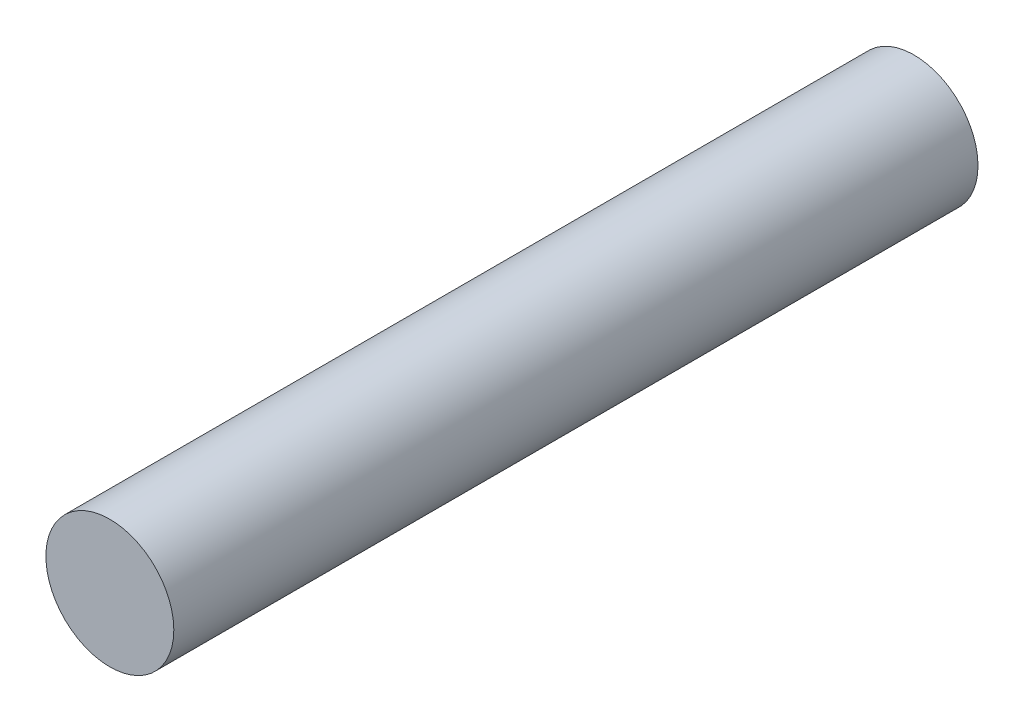
ISO-10303-21;
HEADER;
FILE_DESCRIPTION(('STEP AP214'),'2;1');
FILE_NAME('part.step','',(''),(''),'','','');
FILE_SCHEMA(('AUTOMOTIVE_DESIGN { 1 0 10303 214 1 1 1 1 }'));
ENDSEC;
DATA;
#1=APPLICATION_CONTEXT('core data for automotive mechanical design processes');
#2=APPLICATION_PROTOCOL_DEFINITION('international standard','automotive_design',2000,#1);
#3=PRODUCT_CONTEXT('',#1,'mechanical');
#4=PRODUCT('Part','Part','',(#3));
#5=PRODUCT_RELATED_PRODUCT_CATEGORY('part','',(#4));
#6=PRODUCT_DEFINITION_FORMATION('','',#4);
#7=PRODUCT_DEFINITION_CONTEXT('part definition',#1,'design');
#8=PRODUCT_DEFINITION('design','',#6,#7);
#9=PRODUCT_DEFINITION_SHAPE('','',#8);
#10=(LENGTH_UNIT() NAMED_UNIT(*) SI_UNIT(.MILLI.,.METRE.));
#11=(NAMED_UNIT(*) PLANE_ANGLE_UNIT() SI_UNIT($,.RADIAN.));
#12=(NAMED_UNIT(*) SI_UNIT($,.STERADIAN.) SOLID_ANGLE_UNIT());
#13=UNCERTAINTY_MEASURE_WITH_UNIT(LENGTH_MEASURE(1.E-05),#10,'distance_accuracy_value','');
#14=(GEOMETRIC_REPRESENTATION_CONTEXT(3) GLOBAL_UNCERTAINTY_ASSIGNED_CONTEXT((#13)) GLOBAL_UNIT_ASSIGNED_CONTEXT((#10,
#11,#12)) REPRESENTATION_CONTEXT('',''));
#15=CARTESIAN_POINT('',(0.,0.,0.));
#16=DIRECTION('',(0.,0.,1.));
#17=DIRECTION('',(1.,0.,0.));
#18=AXIS2_PLACEMENT_3D('',#15,#16,#17);
#19=CARTESIAN_POINT('',(0.,0.,139.7));
#20=DIRECTION('',(0.,0.,-1.));
#21=DIRECTION('',(-1.,0.,0.));
#22=AXIS2_PLACEMENT_3D('',#19,#20,#21);
#23=CYLINDRICAL_SURFACE('',#22,11.1125);
#24=CARTESIAN_POINT('',(0.,0.,139.7));
#25=DIRECTION('',(0.,0.,1.));
#26=DIRECTION('',(1.,0.,0.));
#27=AXIS2_PLACEMENT_3D('',#24,#25,#26);
#28=CIRCLE('',#27,11.1125);
#29=CARTESIAN_POINT('',(11.1125,0.,139.7));
#30=VERTEX_POINT('',#29);
#31=EDGE_CURVE('E10',#30,#30,#28,.T.);
#32=ORIENTED_EDGE('',*,*,#31,.F.);
#33=EDGE_LOOP('',(#32));
#34=FACE_BOUND('',#33,.T.);
#35=CARTESIAN_POINT('',(0.,0.,0.));
#36=DIRECTION('',(0.,0.,1.));
#37=DIRECTION('',(1.,0.,0.));
#38=AXIS2_PLACEMENT_3D('',#35,#36,#37);
#39=CIRCLE('',#38,11.1125);
#40=CARTESIAN_POINT('',(11.1125,0.,0.));
#41=VERTEX_POINT('',#40);
#42=EDGE_CURVE('E35',#41,#41,#39,.T.);
#43=ORIENTED_EDGE('',*,*,#42,.T.);
#44=EDGE_LOOP('',(#43));
#45=FACE_BOUND('',#44,.T.);
#46=ADVANCED_FACE('F32',(#34,#45),#23,.T.);
#47=CARTESIAN_POINT('',(0.,0.,139.7));
#48=DIRECTION('',(0.,0.,1.));
#49=DIRECTION('',(1.,0.,0.));
#50=AXIS2_PLACEMENT_3D('',#47,#48,#49);
#51=PLANE('',#50);
#52=ORIENTED_EDGE('',*,*,#31,.T.);
#53=EDGE_LOOP('',(#52));
#54=FACE_BOUND('',#53,.T.);
#55=ADVANCED_FACE('F47',(#54),#51,.T.);
#56=CARTESIAN_POINT('',(0.,0.,0.));
#57=DIRECTION('',(0.,0.,1.));
#58=DIRECTION('',(1.,0.,0.));
#59=AXIS2_PLACEMENT_3D('',#56,#57,#58);
#60=PLANE('',#59);
#61=ORIENTED_EDGE('',*,*,#42,.F.);
#62=EDGE_LOOP('',(#61));
#63=FACE_BOUND('',#62,.T.);
#64=ADVANCED_FACE('F45',(#63),#60,.F.);
#65=CLOSED_SHELL('',(#46,#55,#64));
#66=MANIFOLD_SOLID_BREP('B2',#65);
#67=ADVANCED_BREP_SHAPE_REPRESENTATION('',(#18,#66),#14);
#68=SHAPE_DEFINITION_REPRESENTATION(#9,#67);
ENDSEC;
END-ISO-10303-21;
